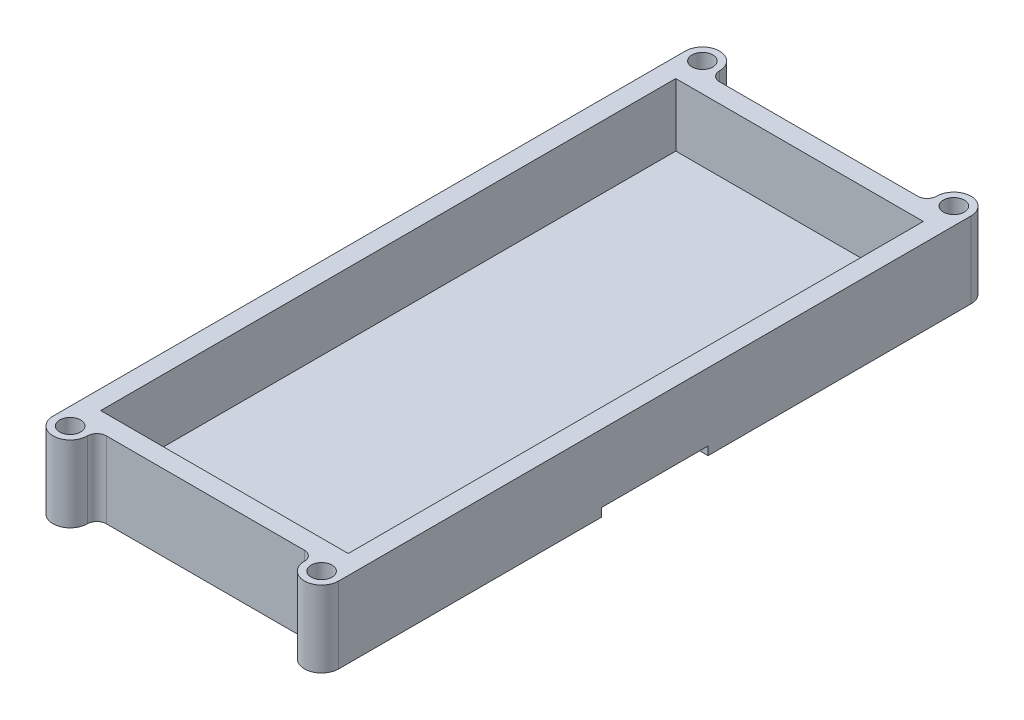
ISO-10303-21;
HEADER;
FILE_DESCRIPTION(('STEP AP214'),'2;1');
FILE_NAME('part.step','',(''),(''),'','','');
FILE_SCHEMA(('AUTOMOTIVE_DESIGN { 1 0 10303 214 1 1 1 1 }'));
ENDSEC;
DATA;
#1=APPLICATION_CONTEXT('core data for automotive mechanical design processes');
#2=APPLICATION_PROTOCOL_DEFINITION('international standard','automotive_design',2000,#1);
#3=PRODUCT_CONTEXT('',#1,'mechanical');
#4=PRODUCT('Part','Part','',(#3));
#5=PRODUCT_RELATED_PRODUCT_CATEGORY('part','',(#4));
#6=PRODUCT_DEFINITION_FORMATION('','',#4);
#7=PRODUCT_DEFINITION_CONTEXT('part definition',#1,'design');
#8=PRODUCT_DEFINITION('design','',#6,#7);
#9=PRODUCT_DEFINITION_SHAPE('','',#8);
#10=(LENGTH_UNIT() NAMED_UNIT(*) SI_UNIT(.MILLI.,.METRE.));
#11=(NAMED_UNIT(*) PLANE_ANGLE_UNIT() SI_UNIT($,.RADIAN.));
#12=(NAMED_UNIT(*) SI_UNIT($,.STERADIAN.) SOLID_ANGLE_UNIT());
#13=UNCERTAINTY_MEASURE_WITH_UNIT(LENGTH_MEASURE(1.E-05),#10,'distance_accuracy_value','');
#14=(GEOMETRIC_REPRESENTATION_CONTEXT(3) GLOBAL_UNCERTAINTY_ASSIGNED_CONTEXT((#13)) GLOBAL_UNIT_ASSIGNED_CONTEXT((#10,
#11,#12)) REPRESENTATION_CONTEXT('',''));
#15=CARTESIAN_POINT('',(0.,0.,0.));
#16=DIRECTION('',(0.,0.,1.));
#17=DIRECTION('',(1.,0.,0.));
#18=AXIS2_PLACEMENT_3D('',#15,#16,#17);
#19=CARTESIAN_POINT('',(33.,0.,83.));
#20=DIRECTION('',(0.,-1.,0.));
#21=DIRECTION('',(0.,0.,-1.));
#22=AXIS2_PLACEMENT_3D('',#19,#20,#21);
#23=PLANE('',#22);
#24=DIRECTION('',(-1.,0.,0.));
#25=VECTOR('',#24,1.);
#26=CARTESIAN_POINT('',(37.5,0.,-13.97));
#27=LINE('',#26,#25);
#28=CARTESIAN_POINT('',(37.5,0.,-13.97));
#29=VERTEX_POINT('',#28);
#30=CARTESIAN_POINT('',(-37.5000000000001,0.,-13.97));
#31=VERTEX_POINT('',#30);
#32=EDGE_CURVE('E171',#29,#31,#27,.T.);
#33=ORIENTED_EDGE('',*,*,#32,.T.);
#34=DIRECTION('',(0.,0.,1.));
#35=VECTOR('',#34,1.);
#36=CARTESIAN_POINT('',(-37.5,0.,75.5));
#37=LINE('',#36,#35);
#38=CARTESIAN_POINT('',(-37.5,0.,-83.));
#39=VERTEX_POINT('',#38);
#40=EDGE_CURVE('E216',#39,#31,#37,.T.);
#41=ORIENTED_EDGE('',*,*,#40,.F.);
#42=CARTESIAN_POINT('',(-33.,0.,-83.));
#43=DIRECTION('',(0.,1.,0.));
#44=DIRECTION('',(0.,0.,-1.));
#45=AXIS2_PLACEMENT_3D('',#42,#43,#44);
#46=CIRCLE('',#45,4.5);
#47=CARTESIAN_POINT('',(-28.5,0.,-83.));
#48=VERTEX_POINT('',#47);
#49=EDGE_CURVE('E212',#48,#39,#46,.T.);
#50=ORIENTED_EDGE('',*,*,#49,.F.);
#51=CARTESIAN_POINT('',(-26.,0.,-83.));
#52=DIRECTION('',(0.,-1.,0.));
#53=DIRECTION('',(0.,0.,-1.));
#54=AXIS2_PLACEMENT_3D('',#51,#52,#53);
#55=CIRCLE('',#54,2.5);
#56=CARTESIAN_POINT('',(-26.,0.,-80.5));
#57=VERTEX_POINT('',#56);
#58=EDGE_CURVE('E42',#48,#57,#55,.F.);
#59=ORIENTED_EDGE('',*,*,#58,.T.);
#60=DIRECTION('',(-1.,0.,0.));
#61=VECTOR('',#60,1.);
#62=CARTESIAN_POINT('',(-28.5,0.,-80.5));
#63=LINE('',#62,#61);
#64=CARTESIAN_POINT('',(26.,0.,-80.5));
#65=VERTEX_POINT('',#64);
#66=EDGE_CURVE('E210',#65,#57,#63,.T.);
#67=ORIENTED_EDGE('',*,*,#66,.F.);
#68=CARTESIAN_POINT('',(26.,0.,-83.));
#69=DIRECTION('',(0.,-1.,0.));
#70=DIRECTION('',(0.,0.,-1.));
#71=AXIS2_PLACEMENT_3D('',#68,#69,#70);
#72=CIRCLE('',#71,2.5);
#73=CARTESIAN_POINT('',(28.5,0.,-83.));
#74=VERTEX_POINT('',#73);
#75=EDGE_CURVE('E268',#65,#74,#72,.F.);
#76=ORIENTED_EDGE('',*,*,#75,.T.);
#77=CARTESIAN_POINT('',(33.,0.,-83.));
#78=DIRECTION('',(0.,1.,0.));
#79=DIRECTION('',(0.,0.,1.));
#80=AXIS2_PLACEMENT_3D('',#77,#78,#79);
#81=CIRCLE('',#80,4.5);
#82=CARTESIAN_POINT('',(37.5,0.,-83.));
#83=VERTEX_POINT('',#82);
#84=EDGE_CURVE('E197',#83,#74,#81,.T.);
#85=ORIENTED_EDGE('',*,*,#84,.F.);
#86=DIRECTION('',(0.,0.,-1.));
#87=VECTOR('',#86,1.);
#88=CARTESIAN_POINT('',(37.5,0.,-75.5));
#89=LINE('',#88,#87);
#90=EDGE_CURVE('E187',#29,#83,#89,.T.);
#91=ORIENTED_EDGE('',*,*,#90,.F.);
#92=EDGE_LOOP('',(#33,#41,#50,#59,#67,#76,#85,#91));
#93=FACE_BOUND('',#92,.T.);
#94=CARTESIAN_POINT('',(-33.,0.,-83.));
#95=DIRECTION('',(0.,1.,0.));
#96=DIRECTION('',(0.,0.,-1.));
#97=AXIS2_PLACEMENT_3D('',#94,#95,#96);
#98=CIRCLE('',#97,2.75);
#99=CARTESIAN_POINT('',(-33.,0.,-85.75));
#100=VERTEX_POINT('',#99);
#101=EDGE_CURVE('E344',#100,#100,#98,.T.);
#102=ORIENTED_EDGE('',*,*,#101,.T.);
#103=EDGE_LOOP('',(#102));
#104=FACE_BOUND('',#103,.T.);
#105=CARTESIAN_POINT('',(33.,0.,-83.));
#106=DIRECTION('',(0.,1.,0.));
#107=DIRECTION('',(0.,0.,1.));
#108=AXIS2_PLACEMENT_3D('',#105,#106,#107);
#109=CIRCLE('',#108,2.75);
#110=CARTESIAN_POINT('',(33.,0.,-80.25));
#111=VERTEX_POINT('',#110);
#112=EDGE_CURVE('E338',#111,#111,#109,.T.);
#113=ORIENTED_EDGE('',*,*,#112,.T.);
#114=EDGE_LOOP('',(#113));
#115=FACE_BOUND('',#114,.T.);
#116=ADVANCED_FACE('F34',(#93,#104,#115),#23,.T.);
#117=CARTESIAN_POINT('',(32.5,20.,75.5));
#118=DIRECTION('',(-1.,0.,0.));
#119=DIRECTION('',(0.,0.,1.));
#120=AXIS2_PLACEMENT_3D('',#117,#118,#119);
#121=PLANE('',#120);
#122=DIRECTION('',(0.,-1.,0.));
#123=VECTOR('',#122,1.);
#124=CARTESIAN_POINT('',(32.5,20.,-75.5));
#125=LINE('',#124,#123);
#126=CARTESIAN_POINT('',(32.5,20.,-75.5));
#127=VERTEX_POINT('',#126);
#128=CARTESIAN_POINT('',(32.5,3.5,-75.5));
#129=VERTEX_POINT('',#128);
#130=EDGE_CURVE('E199',#127,#129,#125,.T.);
#131=ORIENTED_EDGE('',*,*,#130,.T.);
#132=DIRECTION('',(0.,0.,1.));
#133=VECTOR('',#132,1.);
#134=CARTESIAN_POINT('',(32.5,3.5,75.5));
#135=LINE('',#134,#133);
#136=CARTESIAN_POINT('',(32.5,3.5,75.5));
#137=VERTEX_POINT('',#136);
#138=EDGE_CURVE('E352',#129,#137,#135,.T.);
#139=ORIENTED_EDGE('',*,*,#138,.T.);
#140=DIRECTION('',(0.,-1.,0.));
#141=VECTOR('',#140,1.);
#142=CARTESIAN_POINT('',(32.5,20.,75.5));
#143=LINE('',#142,#141);
#144=CARTESIAN_POINT('',(32.5,20.,75.5));
#145=VERTEX_POINT('',#144);
#146=EDGE_CURVE('E313',#145,#137,#143,.T.);
#147=ORIENTED_EDGE('',*,*,#146,.F.);
#148=DIRECTION('',(0.,0.,-1.));
#149=VECTOR('',#148,1.);
#150=CARTESIAN_POINT('',(32.5,20.,75.5));
#151=LINE('',#150,#149);
#152=EDGE_CURVE('E323',#145,#127,#151,.T.);
#153=ORIENTED_EDGE('',*,*,#152,.T.);
#154=EDGE_LOOP('',(#131,#139,#147,#153));
#155=FACE_BOUND('',#154,.T.);
#156=ADVANCED_FACE('F404',(#155),#121,.T.);
#157=CARTESIAN_POINT('',(32.5,20.,-75.5));
#158=DIRECTION('',(0.,0.,1.));
#159=DIRECTION('',(1.,0.,0.));
#160=AXIS2_PLACEMENT_3D('',#157,#158,#159);
#161=PLANE('',#160);
#162=DIRECTION('',(0.,-1.,0.));
#163=VECTOR('',#162,1.);
#164=CARTESIAN_POINT('',(-32.5,20.,-75.5));
#165=LINE('',#164,#163);
#166=CARTESIAN_POINT('',(-32.5,20.,-75.5));
#167=VERTEX_POINT('',#166);
#168=CARTESIAN_POINT('',(-32.5,3.5,-75.5));
#169=VERTEX_POINT('',#168);
#170=EDGE_CURVE('E203',#167,#169,#165,.T.);
#171=ORIENTED_EDGE('',*,*,#170,.T.);
#172=DIRECTION('',(1.,0.,0.));
#173=VECTOR('',#172,1.);
#174=CARTESIAN_POINT('',(-32.5,3.5,-75.5));
#175=LINE('',#174,#173);
#176=EDGE_CURVE('E355',#169,#129,#175,.T.);
#177=ORIENTED_EDGE('',*,*,#176,.T.);
#178=ORIENTED_EDGE('',*,*,#130,.F.);
#179=DIRECTION('',(-1.,0.,0.));
#180=VECTOR('',#179,1.);
#181=CARTESIAN_POINT('',(32.5,20.,-75.5));
#182=LINE('',#181,#180);
#183=EDGE_CURVE('E321',#127,#167,#182,.T.);
#184=ORIENTED_EDGE('',*,*,#183,.T.);
#185=EDGE_LOOP('',(#171,#177,#178,#184));
#186=FACE_BOUND('',#185,.T.);
#187=ADVANCED_FACE('F409',(#186),#161,.T.);
#188=CARTESIAN_POINT('',(-32.5,20.,75.5));
#189=DIRECTION('',(1.,0.,0.));
#190=DIRECTION('',(0.,0.,-1.));
#191=AXIS2_PLACEMENT_3D('',#188,#189,#190);
#192=PLANE('',#191);
#193=DIRECTION('',(0.,-1.,0.));
#194=VECTOR('',#193,1.);
#195=CARTESIAN_POINT('',(-32.5,20.,75.5));
#196=LINE('',#195,#194);
#197=CARTESIAN_POINT('',(-32.5,20.,75.5));
#198=VERTEX_POINT('',#197);
#199=CARTESIAN_POINT('',(-32.5,3.5,75.5));
#200=VERTEX_POINT('',#199);
#201=EDGE_CURVE('E310',#198,#200,#196,.T.);
#202=ORIENTED_EDGE('',*,*,#201,.T.);
#203=DIRECTION('',(0.,0.,-1.));
#204=VECTOR('',#203,1.);
#205=CARTESIAN_POINT('',(-32.5,3.5,75.5));
#206=LINE('',#205,#204);
#207=EDGE_CURVE('E358',#200,#169,#206,.T.);
#208=ORIENTED_EDGE('',*,*,#207,.T.);
#209=ORIENTED_EDGE('',*,*,#170,.F.);
#210=DIRECTION('',(0.,0.,1.));
#211=VECTOR('',#210,1.);
#212=CARTESIAN_POINT('',(-32.5,20.,75.5));
#213=LINE('',#212,#211);
#214=EDGE_CURVE('E318',#167,#198,#213,.T.);
#215=ORIENTED_EDGE('',*,*,#214,.T.);
#216=EDGE_LOOP('',(#202,#208,#209,#215));
#217=FACE_BOUND('',#216,.T.);
#218=ADVANCED_FACE('F425',(#217),#192,.T.);
#219=CARTESIAN_POINT('',(32.5,20.,75.5));
#220=DIRECTION('',(0.,0.,-1.));
#221=DIRECTION('',(-1.,0.,0.));
#222=AXIS2_PLACEMENT_3D('',#219,#220,#221);
#223=PLANE('',#222);
#224=ORIENTED_EDGE('',*,*,#146,.T.);
#225=DIRECTION('',(-1.,0.,0.));
#226=VECTOR('',#225,1.);
#227=CARTESIAN_POINT('',(-32.5,3.5,75.5));
#228=LINE('',#227,#226);
#229=EDGE_CURVE('E347',#137,#200,#228,.T.);
#230=ORIENTED_EDGE('',*,*,#229,.T.);
#231=ORIENTED_EDGE('',*,*,#201,.F.);
#232=DIRECTION('',(1.,0.,0.));
#233=VECTOR('',#232,1.);
#234=CARTESIAN_POINT('',(32.5,20.,75.5));
#235=LINE('',#234,#233);
#236=EDGE_CURVE('E316',#198,#145,#235,.T.);
#237=ORIENTED_EDGE('',*,*,#236,.T.);
#238=EDGE_LOOP('',(#224,#230,#231,#237));
#239=FACE_BOUND('',#238,.T.);
#240=ADVANCED_FACE('F421',(#239),#223,.T.);
#241=CARTESIAN_POINT('',(33.,20.,83.));
#242=DIRECTION('',(0.,-1.,0.));
#243=DIRECTION('',(0.,0.,-1.));
#244=AXIS2_PLACEMENT_3D('',#241,#242,#243);
#245=PLANE('',#244);
#246=DIRECTION('',(0.,0.,-1.));
#247=VECTOR('',#246,1.);
#248=CARTESIAN_POINT('',(37.5,20.,75.5));
#249=LINE('',#248,#247);
#250=CARTESIAN_POINT('',(37.5,20.,83.));
#251=VERTEX_POINT('',#250);
#252=CARTESIAN_POINT('',(37.5,20.,-83.));
#253=VERTEX_POINT('',#252);
#254=EDGE_CURVE('E227',#251,#253,#249,.T.);
#255=ORIENTED_EDGE('',*,*,#254,.T.);
#256=CARTESIAN_POINT('',(33.,20.,-83.));
#257=DIRECTION('',(0.,1.,0.));
#258=DIRECTION('',(0.,0.,1.));
#259=AXIS2_PLACEMENT_3D('',#256,#257,#258);
#260=CIRCLE('',#259,4.5);
#261=CARTESIAN_POINT('',(28.5,20.,-83.));
#262=VERTEX_POINT('',#261);
#263=EDGE_CURVE('E290',#253,#262,#260,.T.);
#264=ORIENTED_EDGE('',*,*,#263,.T.);
#265=CARTESIAN_POINT('',(26.,20.,-83.));
#266=DIRECTION('',(0.,-1.,0.));
#267=DIRECTION('',(0.,0.,-1.));
#268=AXIS2_PLACEMENT_3D('',#265,#266,#267);
#269=CIRCLE('',#268,2.5);
#270=CARTESIAN_POINT('',(26.,20.,-80.5));
#271=VERTEX_POINT('',#270);
#272=EDGE_CURVE('E56',#262,#271,#269,.T.);
#273=ORIENTED_EDGE('',*,*,#272,.T.);
#274=DIRECTION('',(-1.,0.,0.));
#275=VECTOR('',#274,1.);
#276=CARTESIAN_POINT('',(-28.5,20.,-80.5));
#277=LINE('',#276,#275);
#278=CARTESIAN_POINT('',(-26.,20.,-80.5));
#279=VERTEX_POINT('',#278);
#280=EDGE_CURVE('E282',#271,#279,#277,.T.);
#281=ORIENTED_EDGE('',*,*,#280,.T.);
#282=CARTESIAN_POINT('',(-26.,20.,-83.));
#283=DIRECTION('',(0.,-1.,0.));
#284=DIRECTION('',(0.,0.,-1.));
#285=AXIS2_PLACEMENT_3D('',#282,#283,#284);
#286=CIRCLE('',#285,2.5);
#287=CARTESIAN_POINT('',(-28.5,20.,-83.));
#288=VERTEX_POINT('',#287);
#289=EDGE_CURVE('E11',#279,#288,#286,.T.);
#290=ORIENTED_EDGE('',*,*,#289,.T.);
#291=CARTESIAN_POINT('',(-33.,20.,-83.));
#292=DIRECTION('',(0.,1.,0.));
#293=DIRECTION('',(0.,0.,-1.));
#294=AXIS2_PLACEMENT_3D('',#291,#292,#293);
#295=CIRCLE('',#294,4.5);
#296=CARTESIAN_POINT('',(-37.5,20.,-83.));
#297=VERTEX_POINT('',#296);
#298=EDGE_CURVE('E280',#288,#297,#295,.T.);
#299=ORIENTED_EDGE('',*,*,#298,.T.);
#300=DIRECTION('',(0.,0.,1.));
#301=VECTOR('',#300,1.);
#302=CARTESIAN_POINT('',(-37.5,20.,-75.5));
#303=LINE('',#302,#301);
#304=CARTESIAN_POINT('',(-37.5,20.,83.));
#305=VERTEX_POINT('',#304);
#306=EDGE_CURVE('E286',#297,#305,#303,.T.);
#307=ORIENTED_EDGE('',*,*,#306,.T.);
#308=CARTESIAN_POINT('',(-33.,20.,83.));
#309=DIRECTION('',(0.,1.,0.));
#310=DIRECTION('',(0.,0.,1.));
#311=AXIS2_PLACEMENT_3D('',#308,#309,#310);
#312=CIRCLE('',#311,4.5);
#313=CARTESIAN_POINT('',(-28.5,20.,83.));
#314=VERTEX_POINT('',#313);
#315=EDGE_CURVE('E288',#305,#314,#312,.T.);
#316=ORIENTED_EDGE('',*,*,#315,.T.);
#317=CARTESIAN_POINT('',(-26.,20.,83.));
#318=DIRECTION('',(0.,-1.,0.));
#319=DIRECTION('',(0.,0.,-1.));
#320=AXIS2_PLACEMENT_3D('',#317,#318,#319);
#321=CIRCLE('',#320,2.5);
#322=CARTESIAN_POINT('',(-26.,20.,80.5));
#323=VERTEX_POINT('',#322);
#324=EDGE_CURVE('E266',#314,#323,#321,.T.);
#325=ORIENTED_EDGE('',*,*,#324,.T.);
#326=DIRECTION('',(1.,0.,0.));
#327=VECTOR('',#326,1.);
#328=CARTESIAN_POINT('',(-28.5,20.,80.5));
#329=LINE('',#328,#327);
#330=CARTESIAN_POINT('',(26.,20.,80.5));
#331=VERTEX_POINT('',#330);
#332=EDGE_CURVE('E294',#323,#331,#329,.T.);
#333=ORIENTED_EDGE('',*,*,#332,.T.);
#334=CARTESIAN_POINT('',(26.,20.,83.));
#335=DIRECTION('',(0.,-1.,0.));
#336=DIRECTION('',(0.,0.,-1.));
#337=AXIS2_PLACEMENT_3D('',#334,#335,#336);
#338=CIRCLE('',#337,2.5);
#339=CARTESIAN_POINT('',(28.5,20.,83.));
#340=VERTEX_POINT('',#339);
#341=EDGE_CURVE('E262',#331,#340,#338,.T.);
#342=ORIENTED_EDGE('',*,*,#341,.T.);
#343=CARTESIAN_POINT('',(33.,20.,83.));
#344=DIRECTION('',(0.,1.,0.));
#345=DIRECTION('',(0.,0.,-1.));
#346=AXIS2_PLACEMENT_3D('',#343,#344,#345);
#347=CIRCLE('',#346,4.5);
#348=EDGE_CURVE('E207',#340,#251,#347,.T.);
#349=ORIENTED_EDGE('',*,*,#348,.T.);
#350=EDGE_LOOP('',(#255,#264,#273,#281,#290,#299,#307,#316,#325,#333,#342,#349));
#351=FACE_BOUND('',#350,.T.);
#352=ORIENTED_EDGE('',*,*,#152,.F.);
#353=ORIENTED_EDGE('',*,*,#236,.F.);
#354=ORIENTED_EDGE('',*,*,#214,.F.);
#355=ORIENTED_EDGE('',*,*,#183,.F.);
#356=EDGE_LOOP('',(#352,#353,#354,#355));
#357=FACE_BOUND('',#356,.T.);
#358=CARTESIAN_POINT('',(-33.,20.,83.));
#359=DIRECTION('',(0.,1.,0.));
#360=DIRECTION('',(0.,0.,1.));
#361=AXIS2_PLACEMENT_3D('',#358,#359,#360);
#362=CIRCLE('',#361,2.75);
#363=CARTESIAN_POINT('',(-33.,20.,85.75));
#364=VERTEX_POINT('',#363);
#365=EDGE_CURVE('E325',#364,#364,#362,.T.);
#366=ORIENTED_EDGE('',*,*,#365,.F.);
#367=EDGE_LOOP('',(#366));
#368=FACE_BOUND('',#367,.T.);
#369=CARTESIAN_POINT('',(33.,20.,83.));
#370=DIRECTION('',(0.,1.,0.));
#371=DIRECTION('',(0.,0.,-1.));
#372=AXIS2_PLACEMENT_3D('',#369,#370,#371);
#373=CIRCLE('',#372,2.75);
#374=CARTESIAN_POINT('',(33.,20.,80.25));
#375=VERTEX_POINT('',#374);
#376=EDGE_CURVE('E329',#375,#375,#373,.T.);
#377=ORIENTED_EDGE('',*,*,#376,.F.);
#378=EDGE_LOOP('',(#377));
#379=FACE_BOUND('',#378,.T.);
#380=CARTESIAN_POINT('',(33.,20.,-83.));
#381=DIRECTION('',(0.,1.,0.));
#382=DIRECTION('',(0.,0.,1.));
#383=AXIS2_PLACEMENT_3D('',#380,#381,#382);
#384=CIRCLE('',#383,2.75);
#385=CARTESIAN_POINT('',(33.,20.,-80.25));
#386=VERTEX_POINT('',#385);
#387=EDGE_CURVE('E335',#386,#386,#384,.T.);
#388=ORIENTED_EDGE('',*,*,#387,.F.);
#389=EDGE_LOOP('',(#388));
#390=FACE_BOUND('',#389,.T.);
#391=CARTESIAN_POINT('',(-33.,20.,-83.));
#392=DIRECTION('',(0.,1.,0.));
#393=DIRECTION('',(0.,0.,-1.));
#394=AXIS2_PLACEMENT_3D('',#391,#392,#393);
#395=CIRCLE('',#394,2.75);
#396=CARTESIAN_POINT('',(-33.,20.,-85.75));
#397=VERTEX_POINT('',#396);
#398=EDGE_CURVE('E341',#397,#397,#395,.T.);
#399=ORIENTED_EDGE('',*,*,#398,.F.);
#400=EDGE_LOOP('',(#399));
#401=FACE_BOUND('',#400,.T.);
#402=ADVANCED_FACE('F278',(#351,#357,#368,#379,#390,#401),#245,.F.);
#403=DIRECTION('',(-1.,0.,0.));
#404=VECTOR('',#403,1.);
#405=CARTESIAN_POINT('',(37.5,0.,13.97));
#406=LINE('',#405,#404);
#407=CARTESIAN_POINT('',(37.5,0.,13.97));
#408=VERTEX_POINT('',#407);
#409=CARTESIAN_POINT('',(-37.5,0.,13.97));
#410=VERTEX_POINT('',#409);
#411=EDGE_CURVE('E181',#408,#410,#406,.T.);
#412=ORIENTED_EDGE('',*,*,#411,.F.);
#413=CARTESIAN_POINT('',(37.5,0.,83.));
#414=VERTEX_POINT('',#413);
#415=EDGE_CURVE('E198',#414,#408,#89,.T.);
#416=ORIENTED_EDGE('',*,*,#415,.F.);
#417=CARTESIAN_POINT('',(33.,0.,83.));
#418=DIRECTION('',(0.,1.,0.));
#419=DIRECTION('',(0.,0.,-1.));
#420=AXIS2_PLACEMENT_3D('',#417,#418,#419);
#421=CIRCLE('',#420,4.5);
#422=CARTESIAN_POINT('',(28.5,0.,83.));
#423=VERTEX_POINT('',#422);
#424=EDGE_CURVE('E224',#423,#414,#421,.T.);
#425=ORIENTED_EDGE('',*,*,#424,.F.);
#426=CARTESIAN_POINT('',(26.,0.,83.));
#427=DIRECTION('',(0.,-1.,0.));
#428=DIRECTION('',(0.,0.,-1.));
#429=AXIS2_PLACEMENT_3D('',#426,#427,#428);
#430=CIRCLE('',#429,2.5);
#431=CARTESIAN_POINT('',(26.,0.,80.5));
#432=VERTEX_POINT('',#431);
#433=EDGE_CURVE('E260',#423,#432,#430,.F.);
#434=ORIENTED_EDGE('',*,*,#433,.T.);
#435=DIRECTION('',(1.,0.,0.));
#436=VECTOR('',#435,1.);
#437=CARTESIAN_POINT('',(-28.5,0.,80.5));
#438=LINE('',#437,#436);
#439=CARTESIAN_POINT('',(-26.,0.,80.5));
#440=VERTEX_POINT('',#439);
#441=EDGE_CURVE('E221',#440,#432,#438,.T.);
#442=ORIENTED_EDGE('',*,*,#441,.F.);
#443=CARTESIAN_POINT('',(-26.,0.,83.));
#444=DIRECTION('',(0.,-1.,0.));
#445=DIRECTION('',(0.,0.,-1.));
#446=AXIS2_PLACEMENT_3D('',#443,#444,#445);
#447=CIRCLE('',#446,2.5);
#448=CARTESIAN_POINT('',(-28.5,0.,83.));
#449=VERTEX_POINT('',#448);
#450=EDGE_CURVE('E264',#440,#449,#447,.F.);
#451=ORIENTED_EDGE('',*,*,#450,.T.);
#452=CARTESIAN_POINT('',(-33.,0.,83.));
#453=DIRECTION('',(0.,1.,0.));
#454=DIRECTION('',(0.,0.,1.));
#455=AXIS2_PLACEMENT_3D('',#452,#453,#454);
#456=CIRCLE('',#455,4.5);
#457=CARTESIAN_POINT('',(-37.5,0.,83.));
#458=VERTEX_POINT('',#457);
#459=EDGE_CURVE('E218',#458,#449,#456,.T.);
#460=ORIENTED_EDGE('',*,*,#459,.F.);
#461=EDGE_CURVE('E215',#410,#458,#37,.T.);
#462=ORIENTED_EDGE('',*,*,#461,.F.);
#463=EDGE_LOOP('',(#412,#416,#425,#434,#442,#451,#460,#462));
#464=FACE_BOUND('',#463,.T.);
#465=CARTESIAN_POINT('',(-33.,0.,83.));
#466=DIRECTION('',(0.,1.,0.));
#467=DIRECTION('',(0.,0.,1.));
#468=AXIS2_PLACEMENT_3D('',#465,#466,#467);
#469=CIRCLE('',#468,2.75);
#470=CARTESIAN_POINT('',(-33.,0.,85.75));
#471=VERTEX_POINT('',#470);
#472=EDGE_CURVE('E326',#471,#471,#469,.T.);
#473=ORIENTED_EDGE('',*,*,#472,.T.);
#474=EDGE_LOOP('',(#473));
#475=FACE_BOUND('',#474,.T.);
#476=CARTESIAN_POINT('',(33.,0.,83.));
#477=DIRECTION('',(0.,1.,0.));
#478=DIRECTION('',(0.,0.,-1.));
#479=AXIS2_PLACEMENT_3D('',#476,#477,#478);
#480=CIRCLE('',#479,2.75);
#481=CARTESIAN_POINT('',(33.,0.,80.25));
#482=VERTEX_POINT('',#481);
#483=EDGE_CURVE('E332',#482,#482,#480,.T.);
#484=ORIENTED_EDGE('',*,*,#483,.T.);
#485=EDGE_LOOP('',(#484));
#486=FACE_BOUND('',#485,.T.);
#487=ADVANCED_FACE('F379',(#464,#475,#486),#23,.T.);
#488=CARTESIAN_POINT('',(37.5,20.,-75.5));
#489=DIRECTION('',(-1.,0.,0.));
#490=DIRECTION('',(0.,0.,1.));
#491=AXIS2_PLACEMENT_3D('',#488,#489,#490);
#492=PLANE('',#491);
#493=DIRECTION('',(0.,0.,-1.));
#494=VECTOR('',#493,1.);
#495=CARTESIAN_POINT('',(37.5,2.2,-13.97));
#496=LINE('',#495,#494);
#497=CARTESIAN_POINT('',(37.5,2.2,13.97));
#498=VERTEX_POINT('',#497);
#499=CARTESIAN_POINT('',(37.5,2.2,-13.97));
#500=VERTEX_POINT('',#499);
#501=EDGE_CURVE('E182',#498,#500,#496,.T.);
#502=ORIENTED_EDGE('',*,*,#501,.T.);
#503=DIRECTION('',(0.,-1.,0.));
#504=VECTOR('',#503,1.);
#505=CARTESIAN_POINT('',(37.5,2.2,-13.97));
#506=LINE('',#505,#504);
#507=EDGE_CURVE('E174',#500,#29,#506,.T.);
#508=ORIENTED_EDGE('',*,*,#507,.T.);
#509=ORIENTED_EDGE('',*,*,#90,.T.);
#510=DIRECTION('',(0.,-1.,0.));
#511=VECTOR('',#510,1.);
#512=CARTESIAN_POINT('',(37.5,20.,-83.));
#513=LINE('',#512,#511);
#514=EDGE_CURVE('E249',#253,#83,#513,.T.);
#515=ORIENTED_EDGE('',*,*,#514,.F.);
#516=ORIENTED_EDGE('',*,*,#254,.F.);
#517=DIRECTION('',(0.,-1.,0.));
#518=VECTOR('',#517,1.);
#519=CARTESIAN_POINT('',(37.5,20.,83.));
#520=LINE('',#519,#518);
#521=EDGE_CURVE('E228',#251,#414,#520,.T.);
#522=ORIENTED_EDGE('',*,*,#521,.T.);
#523=ORIENTED_EDGE('',*,*,#415,.T.);
#524=DIRECTION('',(0.,1.,0.));
#525=VECTOR('',#524,1.);
#526=CARTESIAN_POINT('',(37.5,2.2,13.97));
#527=LINE('',#526,#525);
#528=EDGE_CURVE('E191',#408,#498,#527,.T.);
#529=ORIENTED_EDGE('',*,*,#528,.T.);
#530=EDGE_LOOP('',(#502,#508,#509,#515,#516,#522,#523,#529));
#531=FACE_BOUND('',#530,.T.);
#532=ADVANCED_FACE('F185',(#531),#492,.F.);
#533=CARTESIAN_POINT('',(33.,20.,-83.));
#534=DIRECTION('',(0.,-1.,0.));
#535=DIRECTION('',(0.,0.,-1.));
#536=AXIS2_PLACEMENT_3D('',#533,#534,#535);
#537=CYLINDRICAL_SURFACE('',#536,4.5);
#538=ORIENTED_EDGE('',*,*,#84,.T.);
#539=DIRECTION('',(0.,-1.,0.));
#540=VECTOR('',#539,1.);
#541=CARTESIAN_POINT('',(28.5,20.,-83.));
#542=LINE('',#541,#540);
#543=EDGE_CURVE('E246',#262,#74,#542,.T.);
#544=ORIENTED_EDGE('',*,*,#543,.F.);
#545=ORIENTED_EDGE('',*,*,#263,.F.);
#546=ORIENTED_EDGE('',*,*,#514,.T.);
#547=EDGE_LOOP('',(#538,#544,#545,#546));
#548=FACE_BOUND('',#547,.T.);
#549=ADVANCED_FACE('F419',(#548),#537,.T.);
#550=CARTESIAN_POINT('',(-28.5,20.,-80.5));
#551=DIRECTION('',(0.,0.,1.));
#552=DIRECTION('',(1.,0.,0.));
#553=AXIS2_PLACEMENT_3D('',#550,#551,#552);
#554=PLANE('',#553);
#555=ORIENTED_EDGE('',*,*,#280,.F.);
#556=DIRECTION('',(0.,-1.,0.));
#557=VECTOR('',#556,1.);
#558=CARTESIAN_POINT('',(26.,0.,-80.5));
#559=LINE('',#558,#557);
#560=EDGE_CURVE('E257',#271,#65,#559,.T.);
#561=ORIENTED_EDGE('',*,*,#560,.T.);
#562=ORIENTED_EDGE('',*,*,#66,.T.);
#563=DIRECTION('',(0.,-1.,0.));
#564=VECTOR('',#563,1.);
#565=CARTESIAN_POINT('',(-26.,20.,-80.5));
#566=LINE('',#565,#564);
#567=EDGE_CURVE('E49',#57,#279,#566,.F.);
#568=ORIENTED_EDGE('',*,*,#567,.T.);
#569=EDGE_LOOP('',(#555,#561,#562,#568));
#570=FACE_BOUND('',#569,.T.);
#571=ADVANCED_FACE('F274',(#570),#554,.F.);
#572=CARTESIAN_POINT('',(-33.,20.,-83.));
#573=DIRECTION('',(0.,-1.,0.));
#574=DIRECTION('',(0.,0.,-1.));
#575=AXIS2_PLACEMENT_3D('',#572,#573,#574);
#576=CYLINDRICAL_SURFACE('',#575,4.5);
#577=ORIENTED_EDGE('',*,*,#49,.T.);
#578=DIRECTION('',(0.,-1.,0.));
#579=VECTOR('',#578,1.);
#580=CARTESIAN_POINT('',(-37.5,20.,-83.));
#581=LINE('',#580,#579);
#582=EDGE_CURVE('E240',#297,#39,#581,.T.);
#583=ORIENTED_EDGE('',*,*,#582,.F.);
#584=ORIENTED_EDGE('',*,*,#298,.F.);
#585=DIRECTION('',(0.,-1.,0.));
#586=VECTOR('',#585,1.);
#587=CARTESIAN_POINT('',(-28.5,20.,-83.));
#588=LINE('',#587,#586);
#589=EDGE_CURVE('E243',#288,#48,#588,.T.);
#590=ORIENTED_EDGE('',*,*,#589,.T.);
#591=EDGE_LOOP('',(#577,#583,#584,#590));
#592=FACE_BOUND('',#591,.T.);
#593=ADVANCED_FACE('F284',(#592),#576,.T.);
#594=CARTESIAN_POINT('',(-37.5,20.,75.5));
#595=DIRECTION('',(1.,0.,0.));
#596=DIRECTION('',(0.,0.,-1.));
#597=AXIS2_PLACEMENT_3D('',#594,#595,#596);
#598=PLANE('',#597);
#599=ORIENTED_EDGE('',*,*,#40,.T.);
#600=DIRECTION('',(0.,-1.,0.));
#601=VECTOR('',#600,1.);
#602=CARTESIAN_POINT('',(-37.5000000000001,2.2,-13.97));
#603=LINE('',#602,#601);
#604=CARTESIAN_POINT('',(-37.5000000000001,2.2,-13.97));
#605=VERTEX_POINT('',#604);
#606=EDGE_CURVE('E177',#605,#31,#603,.T.);
#607=ORIENTED_EDGE('',*,*,#606,.F.);
#608=DIRECTION('',(0.,0.,-1.));
#609=VECTOR('',#608,1.);
#610=CARTESIAN_POINT('',(-37.5000000000001,2.2,-13.97));
#611=LINE('',#610,#609);
#612=CARTESIAN_POINT('',(-37.5000000000001,2.2,13.97));
#613=VERTEX_POINT('',#612);
#614=EDGE_CURVE('E192',#613,#605,#611,.T.);
#615=ORIENTED_EDGE('',*,*,#614,.F.);
#616=DIRECTION('',(0.,1.,0.));
#617=VECTOR('',#616,1.);
#618=CARTESIAN_POINT('',(-37.5000000000001,2.2,13.97));
#619=LINE('',#618,#617);
#620=EDGE_CURVE('E368',#410,#613,#619,.T.);
#621=ORIENTED_EDGE('',*,*,#620,.F.);
#622=ORIENTED_EDGE('',*,*,#461,.T.);
#623=DIRECTION('',(0.,-1.,0.));
#624=VECTOR('',#623,1.);
#625=CARTESIAN_POINT('',(-37.5,20.,83.));
#626=LINE('',#625,#624);
#627=EDGE_CURVE('E237',#305,#458,#626,.T.);
#628=ORIENTED_EDGE('',*,*,#627,.F.);
#629=ORIENTED_EDGE('',*,*,#306,.F.);
#630=ORIENTED_EDGE('',*,*,#582,.T.);
#631=EDGE_LOOP('',(#599,#607,#615,#621,#622,#628,#629,#630));
#632=FACE_BOUND('',#631,.T.);
#633=ADVANCED_FACE('F384',(#632),#598,.F.);
#634=CARTESIAN_POINT('',(-33.,20.,83.));
#635=DIRECTION('',(0.,-1.,0.));
#636=DIRECTION('',(0.,0.,-1.));
#637=AXIS2_PLACEMENT_3D('',#634,#635,#636);
#638=CYLINDRICAL_SURFACE('',#637,4.5);
#639=ORIENTED_EDGE('',*,*,#459,.T.);
#640=DIRECTION('',(0.,-1.,0.));
#641=VECTOR('',#640,1.);
#642=CARTESIAN_POINT('',(-28.5,20.,83.));
#643=LINE('',#642,#641);
#644=EDGE_CURVE('E234',#314,#449,#643,.T.);
#645=ORIENTED_EDGE('',*,*,#644,.F.);
#646=ORIENTED_EDGE('',*,*,#315,.F.);
#647=ORIENTED_EDGE('',*,*,#627,.T.);
#648=EDGE_LOOP('',(#639,#645,#646,#647));
#649=FACE_BOUND('',#648,.T.);
#650=ADVANCED_FACE('F388',(#649),#638,.T.);
#651=CARTESIAN_POINT('',(-28.5,20.,80.5));
#652=DIRECTION('',(0.,0.,-1.));
#653=DIRECTION('',(-1.,0.,0.));
#654=AXIS2_PLACEMENT_3D('',#651,#652,#653);
#655=PLANE('',#654);
#656=ORIENTED_EDGE('',*,*,#441,.T.);
#657=DIRECTION('',(0.,-1.,0.));
#658=VECTOR('',#657,1.);
#659=CARTESIAN_POINT('',(26.,20.,80.5));
#660=LINE('',#659,#658);
#661=EDGE_CURVE('E254',#432,#331,#660,.F.);
#662=ORIENTED_EDGE('',*,*,#661,.T.);
#663=ORIENTED_EDGE('',*,*,#332,.F.);
#664=DIRECTION('',(0.,-1.,0.));
#665=VECTOR('',#664,1.);
#666=CARTESIAN_POINT('',(-26.,0.,80.5));
#667=LINE('',#666,#665);
#668=EDGE_CURVE('E251',#323,#440,#667,.T.);
#669=ORIENTED_EDGE('',*,*,#668,.T.);
#670=EDGE_LOOP('',(#656,#662,#663,#669));
#671=FACE_BOUND('',#670,.T.);
#672=ADVANCED_FACE('F555',(#671),#655,.F.);
#673=CARTESIAN_POINT('',(33.,20.,83.));
#674=DIRECTION('',(0.,-1.,0.));
#675=DIRECTION('',(0.,0.,-1.));
#676=AXIS2_PLACEMENT_3D('',#673,#674,#675);
#677=CYLINDRICAL_SURFACE('',#676,4.5);
#678=ORIENTED_EDGE('',*,*,#424,.T.);
#679=ORIENTED_EDGE('',*,*,#521,.F.);
#680=ORIENTED_EDGE('',*,*,#348,.F.);
#681=DIRECTION('',(0.,-1.,0.));
#682=VECTOR('',#681,1.);
#683=CARTESIAN_POINT('',(28.5,20.,83.));
#684=LINE('',#683,#682);
#685=EDGE_CURVE('E231',#340,#423,#684,.T.);
#686=ORIENTED_EDGE('',*,*,#685,.T.);
#687=EDGE_LOOP('',(#678,#679,#680,#686));
#688=FACE_BOUND('',#687,.T.);
#689=ADVANCED_FACE('F303',(#688),#677,.T.);
#690=CARTESIAN_POINT('',(-33.,20.,83.));
#691=DIRECTION('',(0.,-1.,0.));
#692=DIRECTION('',(0.,0.,-1.));
#693=AXIS2_PLACEMENT_3D('',#690,#691,#692);
#694=CYLINDRICAL_SURFACE('',#693,2.75);
#695=ORIENTED_EDGE('',*,*,#365,.T.);
#696=EDGE_LOOP('',(#695));
#697=FACE_BOUND('',#696,.T.);
#698=ORIENTED_EDGE('',*,*,#472,.F.);
#699=EDGE_LOOP('',(#698));
#700=FACE_BOUND('',#699,.T.);
#701=ADVANCED_FACE('F435',(#697,#700),#694,.F.);
#702=CARTESIAN_POINT('',(33.,20.,83.));
#703=DIRECTION('',(0.,-1.,0.));
#704=DIRECTION('',(0.,0.,-1.));
#705=AXIS2_PLACEMENT_3D('',#702,#703,#704);
#706=CYLINDRICAL_SURFACE('',#705,2.75);
#707=ORIENTED_EDGE('',*,*,#376,.T.);
#708=EDGE_LOOP('',(#707));
#709=FACE_BOUND('',#708,.T.);
#710=ORIENTED_EDGE('',*,*,#483,.F.);
#711=EDGE_LOOP('',(#710));
#712=FACE_BOUND('',#711,.T.);
#713=ADVANCED_FACE('F438',(#709,#712),#706,.F.);
#714=CARTESIAN_POINT('',(33.,20.,-83.));
#715=DIRECTION('',(0.,-1.,0.));
#716=DIRECTION('',(0.,0.,-1.));
#717=AXIS2_PLACEMENT_3D('',#714,#715,#716);
#718=CYLINDRICAL_SURFACE('',#717,2.75);
#719=ORIENTED_EDGE('',*,*,#387,.T.);
#720=EDGE_LOOP('',(#719));
#721=FACE_BOUND('',#720,.T.);
#722=ORIENTED_EDGE('',*,*,#112,.F.);
#723=EDGE_LOOP('',(#722));
#724=FACE_BOUND('',#723,.T.);
#725=ADVANCED_FACE('F442',(#721,#724),#718,.F.);
#726=CARTESIAN_POINT('',(-33.,20.,-83.));
#727=DIRECTION('',(0.,-1.,0.));
#728=DIRECTION('',(0.,0.,-1.));
#729=AXIS2_PLACEMENT_3D('',#726,#727,#728);
#730=CYLINDRICAL_SURFACE('',#729,2.75);
#731=ORIENTED_EDGE('',*,*,#398,.T.);
#732=EDGE_LOOP('',(#731));
#733=FACE_BOUND('',#732,.T.);
#734=ORIENTED_EDGE('',*,*,#101,.F.);
#735=EDGE_LOOP('',(#734));
#736=FACE_BOUND('',#735,.T.);
#737=ADVANCED_FACE('F446',(#733,#736),#730,.F.);
#738=CARTESIAN_POINT('',(0.,3.5,0.));
#739=DIRECTION('',(0.,-1.,0.));
#740=DIRECTION('',(0.,0.,-1.));
#741=AXIS2_PLACEMENT_3D('',#738,#739,#740);
#742=PLANE('',#741);
#743=ORIENTED_EDGE('',*,*,#207,.F.);
#744=ORIENTED_EDGE('',*,*,#229,.F.);
#745=ORIENTED_EDGE('',*,*,#138,.F.);
#746=ORIENTED_EDGE('',*,*,#176,.F.);
#747=EDGE_LOOP('',(#743,#744,#745,#746));
#748=FACE_BOUND('',#747,.T.);
#749=ADVANCED_FACE('F401',(#748),#742,.F.);
#750=CARTESIAN_POINT('',(37.5,2.2,-13.97));
#751=DIRECTION('',(0.,0.,-1.));
#752=DIRECTION('',(-1.,0.,0.));
#753=AXIS2_PLACEMENT_3D('',#750,#751,#752);
#754=PLANE('',#753);
#755=ORIENTED_EDGE('',*,*,#606,.T.);
#756=ORIENTED_EDGE('',*,*,#32,.F.);
#757=ORIENTED_EDGE('',*,*,#507,.F.);
#758=DIRECTION('',(-1.,0.,0.));
#759=VECTOR('',#758,1.);
#760=CARTESIAN_POINT('',(37.5,2.2,-13.97));
#761=LINE('',#760,#759);
#762=EDGE_CURVE('E360',#500,#605,#761,.T.);
#763=ORIENTED_EDGE('',*,*,#762,.T.);
#764=EDGE_LOOP('',(#755,#756,#757,#763));
#765=FACE_BOUND('',#764,.T.);
#766=ADVANCED_FACE('F173',(#765),#754,.F.);
#767=CARTESIAN_POINT('',(37.5,2.2,-13.97));
#768=DIRECTION('',(0.,1.,0.));
#769=DIRECTION('',(0.,0.,1.));
#770=AXIS2_PLACEMENT_3D('',#767,#768,#769);
#771=PLANE('',#770);
#772=ORIENTED_EDGE('',*,*,#614,.T.);
#773=ORIENTED_EDGE('',*,*,#762,.F.);
#774=ORIENTED_EDGE('',*,*,#501,.F.);
#775=DIRECTION('',(-1.,0.,0.));
#776=VECTOR('',#775,1.);
#777=CARTESIAN_POINT('',(37.5,2.2,13.97));
#778=LINE('',#777,#776);
#779=EDGE_CURVE('E363',#498,#613,#778,.T.);
#780=ORIENTED_EDGE('',*,*,#779,.T.);
#781=EDGE_LOOP('',(#772,#773,#774,#780));
#782=FACE_BOUND('',#781,.T.);
#783=ADVANCED_FACE('F392',(#782),#771,.F.);
#784=CARTESIAN_POINT('',(37.5,2.2,13.97));
#785=DIRECTION('',(0.,0.,1.));
#786=DIRECTION('',(1.,0.,0.));
#787=AXIS2_PLACEMENT_3D('',#784,#785,#786);
#788=PLANE('',#787);
#789=ORIENTED_EDGE('',*,*,#620,.T.);
#790=ORIENTED_EDGE('',*,*,#779,.F.);
#791=ORIENTED_EDGE('',*,*,#528,.F.);
#792=ORIENTED_EDGE('',*,*,#411,.T.);
#793=EDGE_LOOP('',(#789,#790,#791,#792));
#794=FACE_BOUND('',#793,.T.);
#795=ADVANCED_FACE('F375',(#794),#788,.F.);
#796=CARTESIAN_POINT('',(26.,20.,83.));
#797=DIRECTION('',(0.,1.,0.));
#798=DIRECTION('',(0.,0.,1.));
#799=AXIS2_PLACEMENT_3D('',#796,#797,#798);
#800=CYLINDRICAL_SURFACE('',#799,2.5);
#801=ORIENTED_EDGE('',*,*,#341,.F.);
#802=ORIENTED_EDGE('',*,*,#661,.F.);
#803=ORIENTED_EDGE('',*,*,#433,.F.);
#804=ORIENTED_EDGE('',*,*,#685,.F.);
#805=EDGE_LOOP('',(#801,#802,#803,#804));
#806=FACE_BOUND('',#805,.T.);
#807=ADVANCED_FACE('F399',(#806),#800,.F.);
#808=CARTESIAN_POINT('',(-26.,20.,83.));
#809=DIRECTION('',(0.,1.,0.));
#810=DIRECTION('',(0.,0.,1.));
#811=AXIS2_PLACEMENT_3D('',#808,#809,#810);
#812=CYLINDRICAL_SURFACE('',#811,2.5);
#813=ORIENTED_EDGE('',*,*,#324,.F.);
#814=ORIENTED_EDGE('',*,*,#644,.T.);
#815=ORIENTED_EDGE('',*,*,#450,.F.);
#816=ORIENTED_EDGE('',*,*,#668,.F.);
#817=EDGE_LOOP('',(#813,#814,#815,#816));
#818=FACE_BOUND('',#817,.T.);
#819=ADVANCED_FACE('F579',(#818),#812,.F.);
#820=CARTESIAN_POINT('',(26.,20.,-83.));
#821=DIRECTION('',(0.,1.,0.));
#822=DIRECTION('',(0.,0.,1.));
#823=AXIS2_PLACEMENT_3D('',#820,#821,#822);
#824=CYLINDRICAL_SURFACE('',#823,2.5);
#825=ORIENTED_EDGE('',*,*,#272,.F.);
#826=ORIENTED_EDGE('',*,*,#543,.T.);
#827=ORIENTED_EDGE('',*,*,#75,.F.);
#828=ORIENTED_EDGE('',*,*,#560,.F.);
#829=EDGE_LOOP('',(#825,#826,#827,#828));
#830=FACE_BOUND('',#829,.T.);
#831=ADVANCED_FACE('F589',(#830),#824,.F.);
#832=CARTESIAN_POINT('',(-26.,20.,-83.));
#833=DIRECTION('',(0.,1.,0.));
#834=DIRECTION('',(0.,0.,1.));
#835=AXIS2_PLACEMENT_3D('',#832,#833,#834);
#836=CYLINDRICAL_SURFACE('',#835,2.5);
#837=ORIENTED_EDGE('',*,*,#289,.F.);
#838=ORIENTED_EDGE('',*,*,#567,.F.);
#839=ORIENTED_EDGE('',*,*,#58,.F.);
#840=ORIENTED_EDGE('',*,*,#589,.F.);
#841=EDGE_LOOP('',(#837,#838,#839,#840));
#842=FACE_BOUND('',#841,.T.);
#843=ADVANCED_FACE('F36',(#842),#836,.F.);
#844=CLOSED_SHELL('',(#116,#156,#187,#218,#240,#402,#487,#532,#549,#571,#593,#633,#650,#672,
#689,#701,#713,#725,#737,#749,#766,#783,#795,#807,#819,#831,#843));
#845=MANIFOLD_SOLID_BREP('B2',#844);
#846=ADVANCED_BREP_SHAPE_REPRESENTATION('',(#18,#845),#14);
#847=SHAPE_DEFINITION_REPRESENTATION(#9,#846);
ENDSEC;
END-ISO-10303-21;
